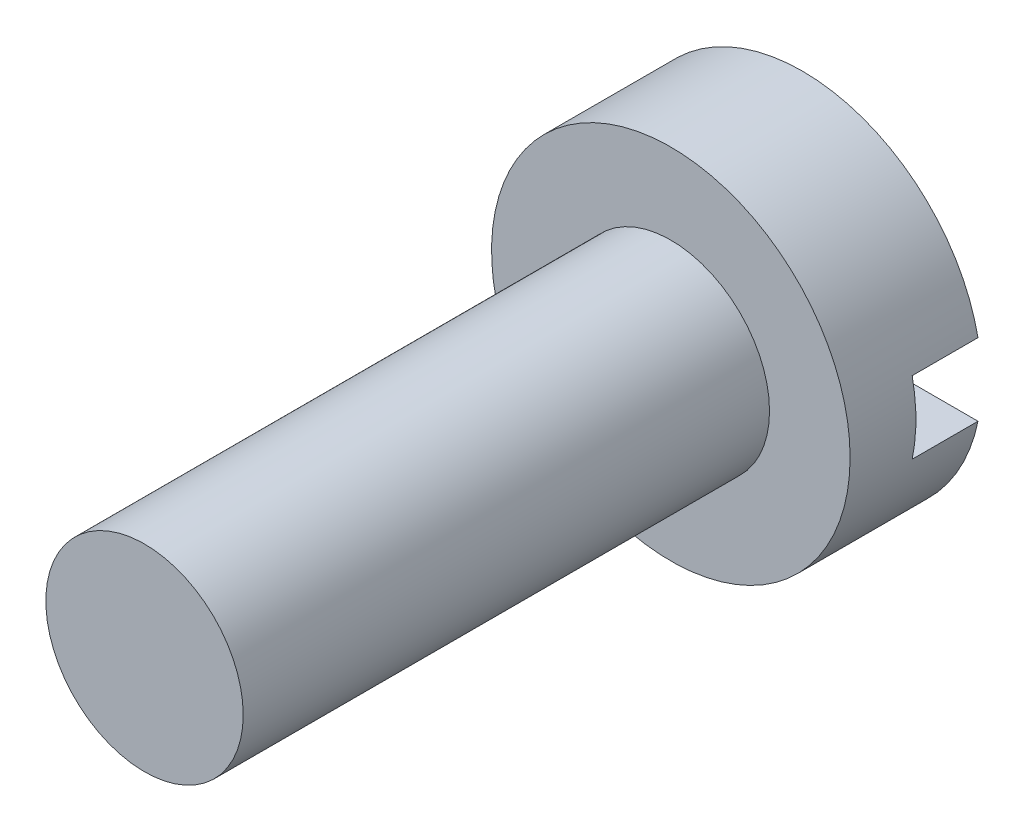
ISO-10303-21;
HEADER;
FILE_DESCRIPTION(('STEP AP214'),'2;1');
FILE_NAME('part.step','',(''),(''),'','','');
FILE_SCHEMA(('AUTOMOTIVE_DESIGN { 1 0 10303 214 1 1 1 1 }'));
ENDSEC;
DATA;
#1=APPLICATION_CONTEXT('core data for automotive mechanical design processes');
#2=APPLICATION_PROTOCOL_DEFINITION('international standard','automotive_design',2000,#1);
#3=PRODUCT_CONTEXT('',#1,'mechanical');
#4=PRODUCT('Part','Part','',(#3));
#5=PRODUCT_RELATED_PRODUCT_CATEGORY('part','',(#4));
#6=PRODUCT_DEFINITION_FORMATION('','',#4);
#7=PRODUCT_DEFINITION_CONTEXT('part definition',#1,'design');
#8=PRODUCT_DEFINITION('design','',#6,#7);
#9=PRODUCT_DEFINITION_SHAPE('','',#8);
#10=(LENGTH_UNIT() NAMED_UNIT(*) SI_UNIT(.MILLI.,.METRE.));
#11=(NAMED_UNIT(*) PLANE_ANGLE_UNIT() SI_UNIT($,.RADIAN.));
#12=(NAMED_UNIT(*) SI_UNIT($,.STERADIAN.) SOLID_ANGLE_UNIT());
#13=UNCERTAINTY_MEASURE_WITH_UNIT(LENGTH_MEASURE(1.E-05),#10,'distance_accuracy_value','');
#14=(GEOMETRIC_REPRESENTATION_CONTEXT(3) GLOBAL_UNCERTAINTY_ASSIGNED_CONTEXT((#13)) GLOBAL_UNIT_ASSIGNED_CONTEXT((#10,
#11,#12)) REPRESENTATION_CONTEXT('',''));
#15=CARTESIAN_POINT('',(0.,0.,0.));
#16=DIRECTION('',(0.,0.,1.));
#17=DIRECTION('',(1.,0.,0.));
#18=AXIS2_PLACEMENT_3D('',#15,#16,#17);
#19=CARTESIAN_POINT('',(0.,0.,2.));
#20=DIRECTION('',(0.,0.,1.));
#21=DIRECTION('',(1.,0.,0.));
#22=AXIS2_PLACEMENT_3D('',#19,#20,#21);
#23=PLANE('',#22);
#24=CARTESIAN_POINT('',(0.,0.,2.));
#25=DIRECTION('',(0.,0.,1.));
#26=DIRECTION('',(1.,0.,0.));
#27=AXIS2_PLACEMENT_3D('',#24,#25,#26);
#28=CIRCLE('',#27,2.725);
#29=CARTESIAN_POINT('',(2.725,0.,2.));
#30=VERTEX_POINT('',#29);
#31=EDGE_CURVE('E80',#30,#30,#28,.T.);
#32=ORIENTED_EDGE('',*,*,#31,.T.);
#33=EDGE_LOOP('',(#32));
#34=FACE_BOUND('',#33,.T.);
#35=CARTESIAN_POINT('',(0.,0.,2.));
#36=DIRECTION('',(0.,0.,1.));
#37=DIRECTION('',(1.,0.,0.));
#38=AXIS2_PLACEMENT_3D('',#35,#36,#37);
#39=CIRCLE('',#38,1.5);
#40=CARTESIAN_POINT('',(1.5,0.,2.));
#41=VERTEX_POINT('',#40);
#42=EDGE_CURVE('E146',#41,#41,#39,.T.);
#43=ORIENTED_EDGE('',*,*,#42,.F.);
#44=EDGE_LOOP('',(#43));
#45=FACE_BOUND('',#44,.T.);
#46=ADVANCED_FACE('F32',(#34,#45),#23,.T.);
#47=CARTESIAN_POINT('',(0.,0.,0.));
#48=DIRECTION('',(0.,0.,1.));
#49=DIRECTION('',(1.,0.,0.));
#50=AXIS2_PLACEMENT_3D('',#47,#48,#49);
#51=PLANE('',#50);
#52=CARTESIAN_POINT('',(0.,0.,0.));
#53=DIRECTION('',(0.,0.,1.));
#54=DIRECTION('',(1.,0.,0.));
#55=AXIS2_PLACEMENT_3D('',#52,#53,#54);
#56=CIRCLE('',#55,2.725);
#57=CARTESIAN_POINT('',(-2.66891832021889,-0.55,0.));
#58=VERTEX_POINT('',#57);
#59=CARTESIAN_POINT('',(2.66891832021889,-0.55,0.));
#60=VERTEX_POINT('',#59);
#61=EDGE_CURVE('E91',#58,#60,#56,.T.);
#62=ORIENTED_EDGE('',*,*,#61,.F.);
#63=DIRECTION('',(1.,0.,0.));
#64=VECTOR('',#63,1.);
#65=CARTESIAN_POINT('',(0.,-0.55,0.));
#66=LINE('',#65,#64);
#67=EDGE_CURVE('E79',#58,#60,#66,.T.);
#68=ORIENTED_EDGE('',*,*,#67,.T.);
#69=EDGE_LOOP('',(#62,#68));
#70=FACE_BOUND('',#69,.T.);
#71=ADVANCED_FACE('F109',(#70),#51,.F.);
#72=CARTESIAN_POINT('',(0.,0.,2.));
#73=DIRECTION('',(0.,0.,-1.));
#74=DIRECTION('',(-1.,0.,0.));
#75=AXIS2_PLACEMENT_3D('',#72,#73,#74);
#76=CYLINDRICAL_SURFACE('',#75,2.725);
#77=ORIENTED_EDGE('',*,*,#61,.T.);
#78=DIRECTION('',(0.,0.,-1.));
#79=VECTOR('',#78,1.);
#80=CARTESIAN_POINT('',(2.66891832021889,-0.55,2.));
#81=LINE('',#80,#79);
#82=CARTESIAN_POINT('',(2.66891832021889,-0.55,1.));
#83=VERTEX_POINT('',#82);
#84=EDGE_CURVE('E88',#60,#83,#81,.F.);
#85=ORIENTED_EDGE('',*,*,#84,.T.);
#86=CARTESIAN_POINT('',(0.,0.,1.));
#87=DIRECTION('',(0.,0.,-1.));
#88=DIRECTION('',(-1.,0.,0.));
#89=AXIS2_PLACEMENT_3D('',#86,#87,#88);
#90=CIRCLE('',#89,2.725);
#91=CARTESIAN_POINT('',(2.66891832021889,0.55,1.));
#92=VERTEX_POINT('',#91);
#93=EDGE_CURVE('E11',#92,#83,#90,.T.);
#94=ORIENTED_EDGE('',*,*,#93,.F.);
#95=DIRECTION('',(0.,0.,-1.));
#96=VECTOR('',#95,1.);
#97=CARTESIAN_POINT('',(2.66891832021889,0.55,2.));
#98=LINE('',#97,#96);
#99=CARTESIAN_POINT('',(2.66891832021889,0.55,0.));
#100=VERTEX_POINT('',#99);
#101=EDGE_CURVE('E74',#92,#100,#98,.T.);
#102=ORIENTED_EDGE('',*,*,#101,.T.);
#103=CARTESIAN_POINT('',(-2.66891832021889,0.55,0.));
#104=VERTEX_POINT('',#103);
#105=EDGE_CURVE('E86',#100,#104,#56,.T.);
#106=ORIENTED_EDGE('',*,*,#105,.T.);
#107=DIRECTION('',(0.,0.,-1.));
#108=VECTOR('',#107,1.);
#109=CARTESIAN_POINT('',(-2.66891832021889,0.55,2.));
#110=LINE('',#109,#108);
#111=CARTESIAN_POINT('',(-2.66891832021889,0.55,1.));
#112=VERTEX_POINT('',#111);
#113=EDGE_CURVE('E47',#104,#112,#110,.F.);
#114=ORIENTED_EDGE('',*,*,#113,.T.);
#115=CARTESIAN_POINT('',(-2.66891832021889,-0.55,1.));
#116=VERTEX_POINT('',#115);
#117=EDGE_CURVE('E36',#116,#112,#90,.T.);
#118=ORIENTED_EDGE('',*,*,#117,.F.);
#119=DIRECTION('',(0.,0.,-1.));
#120=VECTOR('',#119,1.);
#121=CARTESIAN_POINT('',(-2.66891832021889,-0.55,2.));
#122=LINE('',#121,#120);
#123=EDGE_CURVE('E55',#116,#58,#122,.T.);
#124=ORIENTED_EDGE('',*,*,#123,.T.);
#125=EDGE_LOOP('',(#77,#85,#94,#102,#106,#114,#118,#124));
#126=FACE_BOUND('',#125,.T.);
#127=ORIENTED_EDGE('',*,*,#31,.F.);
#128=EDGE_LOOP('',(#127));
#129=FACE_BOUND('',#128,.T.);
#130=ADVANCED_FACE('F34',(#126,#129),#76,.T.);
#131=ORIENTED_EDGE('',*,*,#105,.F.);
#132=DIRECTION('',(-1.,0.,0.));
#133=VECTOR('',#132,1.);
#134=CARTESIAN_POINT('',(0.,0.55,0.));
#135=LINE('',#134,#133);
#136=EDGE_CURVE('E71',#100,#104,#135,.T.);
#137=ORIENTED_EDGE('',*,*,#136,.T.);
#138=EDGE_LOOP('',(#131,#137));
#139=FACE_BOUND('',#138,.T.);
#140=ADVANCED_FACE('F90',(#139),#51,.F.);
#141=CARTESIAN_POINT('',(-3.44980190887808,0.55,1.));
#142=DIRECTION('',(0.,0.,-1.));
#143=DIRECTION('',(-1.,0.,0.));
#144=AXIS2_PLACEMENT_3D('',#141,#142,#143);
#145=PLANE('',#144);
#146=ORIENTED_EDGE('',*,*,#93,.T.);
#147=DIRECTION('',(-1.,0.,0.));
#148=VECTOR('',#147,1.);
#149=CARTESIAN_POINT('',(3.90126958400864,-0.55,1.));
#150=LINE('',#149,#148);
#151=EDGE_CURVE('E104',#83,#116,#150,.T.);
#152=ORIENTED_EDGE('',*,*,#151,.T.);
#153=ORIENTED_EDGE('',*,*,#117,.T.);
#154=DIRECTION('',(1.,0.,0.));
#155=VECTOR('',#154,1.);
#156=CARTESIAN_POINT('',(-3.44980190887808,0.55,1.));
#157=LINE('',#156,#155);
#158=EDGE_CURVE('E103',#112,#92,#157,.T.);
#159=ORIENTED_EDGE('',*,*,#158,.T.);
#160=EDGE_LOOP('',(#146,#152,#153,#159));
#161=FACE_BOUND('',#160,.T.);
#162=ADVANCED_FACE('F102',(#161),#145,.T.);
#163=CARTESIAN_POINT('',(3.90126958400864,-0.55,1.));
#164=DIRECTION('',(0.,-1.,0.));
#165=DIRECTION('',(0.,0.,-1.));
#166=AXIS2_PLACEMENT_3D('',#163,#164,#165);
#167=PLANE('',#166);
#168=ORIENTED_EDGE('',*,*,#151,.F.);
#169=ORIENTED_EDGE('',*,*,#84,.F.);
#170=ORIENTED_EDGE('',*,*,#67,.F.);
#171=ORIENTED_EDGE('',*,*,#123,.F.);
#172=EDGE_LOOP('',(#168,#169,#170,#171));
#173=FACE_BOUND('',#172,.T.);
#174=ADVANCED_FACE('F122',(#173),#167,.F.);
#175=CARTESIAN_POINT('',(-3.44980190887808,0.55,1.));
#176=DIRECTION('',(0.,1.,0.));
#177=DIRECTION('',(0.,0.,1.));
#178=AXIS2_PLACEMENT_3D('',#175,#176,#177);
#179=PLANE('',#178);
#180=ORIENTED_EDGE('',*,*,#158,.F.);
#181=ORIENTED_EDGE('',*,*,#113,.F.);
#182=ORIENTED_EDGE('',*,*,#136,.F.);
#183=ORIENTED_EDGE('',*,*,#101,.F.);
#184=EDGE_LOOP('',(#180,#181,#182,#183));
#185=FACE_BOUND('',#184,.T.);
#186=ADVANCED_FACE('F73',(#185),#179,.F.);
#187=CARTESIAN_POINT('',(0.,0.,10.));
#188=DIRECTION('',(0.,0.,-1.));
#189=DIRECTION('',(-1.,0.,0.));
#190=AXIS2_PLACEMENT_3D('',#187,#188,#189);
#191=CYLINDRICAL_SURFACE('',#190,1.5);
#192=CARTESIAN_POINT('',(0.,0.,10.));
#193=DIRECTION('',(0.,0.,1.));
#194=DIRECTION('',(1.,0.,0.));
#195=AXIS2_PLACEMENT_3D('',#192,#193,#194);
#196=CIRCLE('',#195,1.5);
#197=CARTESIAN_POINT('',(1.5,0.,10.));
#198=VERTEX_POINT('',#197);
#199=EDGE_CURVE('E105',#198,#198,#196,.T.);
#200=ORIENTED_EDGE('',*,*,#199,.F.);
#201=EDGE_LOOP('',(#200));
#202=FACE_BOUND('',#201,.T.);
#203=ORIENTED_EDGE('',*,*,#42,.T.);
#204=EDGE_LOOP('',(#203));
#205=FACE_BOUND('',#204,.T.);
#206=ADVANCED_FACE('F129',(#202,#205),#191,.T.);
#207=CARTESIAN_POINT('',(0.,0.,10.));
#208=DIRECTION('',(0.,0.,1.));
#209=DIRECTION('',(1.,0.,0.));
#210=AXIS2_PLACEMENT_3D('',#207,#208,#209);
#211=PLANE('',#210);
#212=ORIENTED_EDGE('',*,*,#199,.T.);
#213=EDGE_LOOP('',(#212));
#214=FACE_BOUND('',#213,.T.);
#215=ADVANCED_FACE('F135',(#214),#211,.T.);
#216=CLOSED_SHELL('',(#46,#71,#130,#140,#162,#174,#186,#206,#215));
#217=MANIFOLD_SOLID_BREP('B2',#216);
#218=ADVANCED_BREP_SHAPE_REPRESENTATION('',(#18,#217),#14);
#219=SHAPE_DEFINITION_REPRESENTATION(#9,#218);
ENDSEC;
END-ISO-10303-21;
